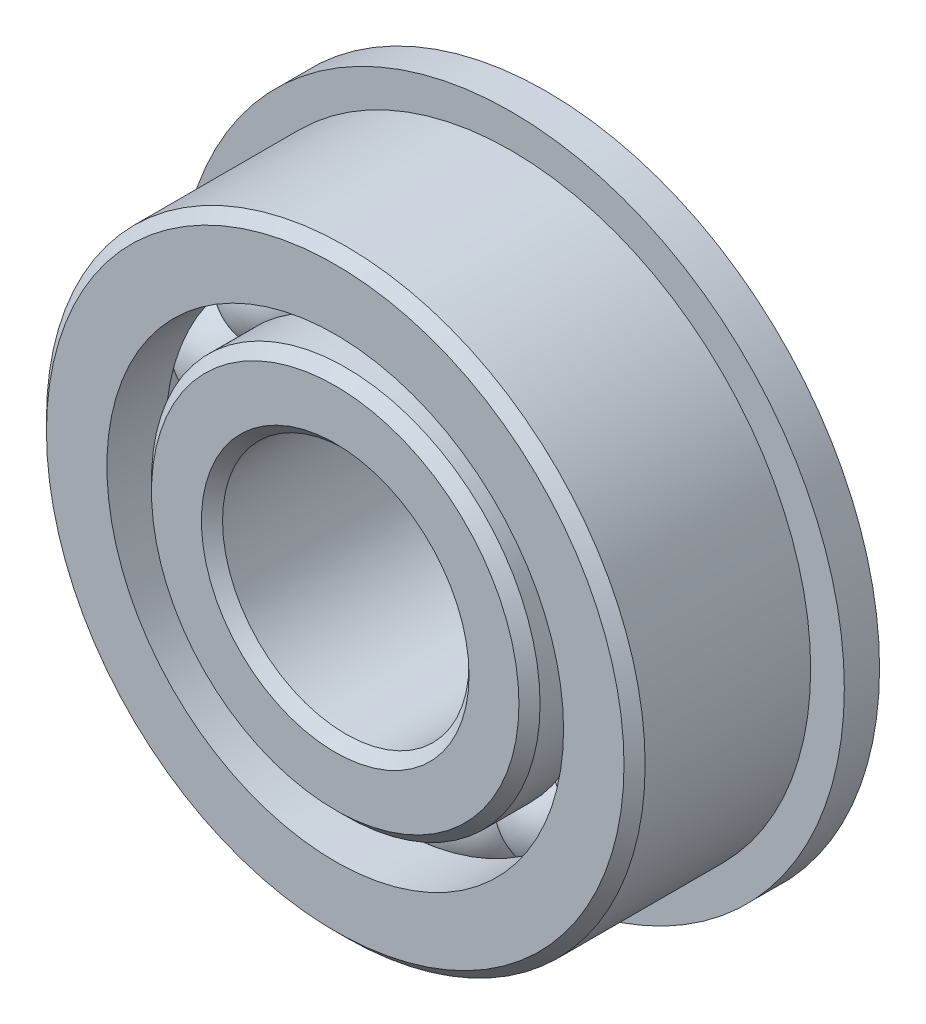
ISO-10303-21;
HEADER;
FILE_DESCRIPTION(('STEP AP214'),'2;1');
FILE_NAME('part.step','',(''),(''),'','','');
FILE_SCHEMA(('AUTOMOTIVE_DESIGN { 1 0 10303 214 1 1 1 1 }'));
ENDSEC;
DATA;
#1=APPLICATION_CONTEXT('core data for automotive mechanical design processes');
#2=APPLICATION_PROTOCOL_DEFINITION('international standard','automotive_design',2000,#1);
#3=PRODUCT_CONTEXT('',#1,'mechanical');
#4=PRODUCT('Part','Part','',(#3));
#5=PRODUCT_RELATED_PRODUCT_CATEGORY('part','',(#4));
#6=PRODUCT_DEFINITION_FORMATION('','',#4);
#7=PRODUCT_DEFINITION_CONTEXT('part definition',#1,'design');
#8=PRODUCT_DEFINITION('design','',#6,#7);
#9=PRODUCT_DEFINITION_SHAPE('','',#8);
#10=(LENGTH_UNIT() NAMED_UNIT(*) SI_UNIT(.MILLI.,.METRE.));
#11=(NAMED_UNIT(*) PLANE_ANGLE_UNIT() SI_UNIT($,.RADIAN.));
#12=(NAMED_UNIT(*) SI_UNIT($,.STERADIAN.) SOLID_ANGLE_UNIT());
#13=UNCERTAINTY_MEASURE_WITH_UNIT(LENGTH_MEASURE(1.E-05),#10,'distance_accuracy_value','');
#14=(GEOMETRIC_REPRESENTATION_CONTEXT(3) GLOBAL_UNCERTAINTY_ASSIGNED_CONTEXT((#13)) GLOBAL_UNIT_ASSIGNED_CONTEXT((#10,
#11,#12)) REPRESENTATION_CONTEXT('',''));
#15=CARTESIAN_POINT('',(0.,0.,0.));
#16=DIRECTION('',(0.,0.,1.));
#17=DIRECTION('',(1.,0.,0.));
#18=AXIS2_PLACEMENT_3D('',#15,#16,#17);
#19=CARTESIAN_POINT('',(-3.87416652529689,8.70152048404582,0.));
#20=DIRECTION('',(0.,0.,1.));
#21=DIRECTION('',(-0.406736643075789,0.913545457642606,0.));
#22=AXIS2_PLACEMENT_3D('',#19,#20,#21);
#23=SPHERICAL_SURFACE('',#22,2.25154625658889);
#24=CARTESIAN_POINT('',(-3.87416652529689,8.70152048404582,2.25154625658889));
#25=VERTEX_POINT('',#24);
#26=VERTEX_LOOP('',#25);
#27=FACE_BOUND('',#26,.T.);
#28=ADVANCED_FACE('F37',(#27),#23,.T.);
#29=CLOSED_SHELL('',(#28));
#30=MANIFOLD_SOLID_BREP('B2',#29);
#31=CARTESIAN_POINT('',(-7.0784544626721,6.37346902556821,0.));
#32=DIRECTION('',(0.,0.,1.));
#33=DIRECTION('',(-0.743144825477386,0.669130606358867,0.));
#34=AXIS2_PLACEMENT_3D('',#31,#32,#33);
#35=SPHERICAL_SURFACE('',#34,2.25154625658889);
#36=CARTESIAN_POINT('',(-7.0784544626721,6.37346902556821,2.25154625658889));
#37=VERTEX_POINT('',#36);
#38=VERTEX_LOOP('',#37);
#39=FACE_BOUND('',#38,.T.);
#40=ADVANCED_FACE('F57',(#39),#35,.T.);
#41=CLOSED_SHELL('',(#40));
#42=MANIFOLD_SOLID_BREP('B6',#41);
#43=CARTESIAN_POINT('',(-9.05881331771131,2.94338687142147,0.));
#44=DIRECTION('',(0.,0.,1.));
#45=DIRECTION('',(-0.95105651629515,0.309016994374957,0.));
#46=AXIS2_PLACEMENT_3D('',#43,#44,#45);
#47=SPHERICAL_SURFACE('',#46,2.25154625658889);
#48=CARTESIAN_POINT('',(-9.05881331771131,2.94338687142147,2.25154625658889));
#49=VERTEX_POINT('',#48);
#50=VERTEX_LOOP('',#49);
#51=FACE_BOUND('',#50,.T.);
#52=ADVANCED_FACE('F77',(#51),#47,.T.);
#53=CLOSED_SHELL('',(#52));
#54=MANIFOLD_SOLID_BREP('B33',#53);
#55=CARTESIAN_POINT('',(-9.47282105338281,-0.995633612624306,0.));
#56=DIRECTION('',(0.,0.,1.));
#57=DIRECTION('',(-0.994521895368274,-0.104528463267644,0.));
#58=AXIS2_PLACEMENT_3D('',#55,#56,#57);
#59=SPHERICAL_SURFACE('',#58,2.25154625658889);
#60=CARTESIAN_POINT('',(-9.47282105338281,-0.995633612624306,2.25154625658889));
#61=VERTEX_POINT('',#60);
#62=VERTEX_LOOP('',#61);
#63=FACE_BOUND('',#62,.T.);
#64=ADVANCED_FACE('F97',(#63),#59,.T.);
#65=CLOSED_SHELL('',(#64));
#66=MANIFOLD_SOLID_BREP('B53',#65);
#67=CARTESIAN_POINT('',(-8.24889197104682,-4.76249999999992,0.));
#68=DIRECTION('',(0.,0.,1.));
#69=DIRECTION('',(-0.866025403784443,-0.499999999999992,0.));
#70=AXIS2_PLACEMENT_3D('',#67,#68,#69);
#71=SPHERICAL_SURFACE('',#70,2.25154625658889);
#72=CARTESIAN_POINT('',(-8.24889197104682,-4.76249999999992,2.25154625658889));
#73=VERTEX_POINT('',#72);
#74=VERTEX_LOOP('',#73);
#75=FACE_BOUND('',#74,.T.);
#76=ADVANCED_FACE('F117',(#75),#71,.T.);
#77=CLOSED_SHELL('',(#76));
#78=MANIFOLD_SOLID_BREP('B73',#77);
#79=CARTESIAN_POINT('',(-5.59865452808587,-7.70588687142133,0.));
#80=DIRECTION('',(0.,0.,1.));
#81=DIRECTION('',(-0.58778525229248,-0.809016994374943,0.));
#82=AXIS2_PLACEMENT_3D('',#79,#80,#81);
#83=SPHERICAL_SURFACE('',#82,2.25154625658889);
#84=CARTESIAN_POINT('',(-5.59865452808587,-7.70588687142133,2.25154625658889));
#85=VERTEX_POINT('',#84);
#86=VERTEX_LOOP('',#85);
#87=FACE_BOUND('',#86,.T.);
#88=ADVANCED_FACE('F137',(#87),#83,.T.);
#89=CLOSED_SHELL('',(#88));
#90=MANIFOLD_SOLID_BREP('B93',#89);
#91=CARTESIAN_POINT('',(-1.98035885503923,-9.31685589698948,0.));
#92=DIRECTION('',(0.,0.,1.));
#93=DIRECTION('',(-0.207911690817766,-0.978147600733804,0.));
#94=AXIS2_PLACEMENT_3D('',#91,#92,#93);
#95=SPHERICAL_SURFACE('',#94,2.25154625658889);
#96=CARTESIAN_POINT('',(-1.98035885503923,-9.31685589698948,2.25154625658889));
#97=VERTEX_POINT('',#96);
#98=VERTEX_LOOP('',#97);
#99=FACE_BOUND('',#98,.T.);
#100=ADVANCED_FACE('F157',(#99),#95,.T.);
#101=CLOSED_SHELL('',(#100));
#102=MANIFOLD_SOLID_BREP('B113',#101);
#103=CARTESIAN_POINT('',(1.9803588550391,-9.31685589698951,0.));
#104=DIRECTION('',(0.,0.,1.));
#105=DIRECTION('',(0.207911690817753,-0.978147600733807,0.));
#106=AXIS2_PLACEMENT_3D('',#103,#104,#105);
#107=SPHERICAL_SURFACE('',#106,2.25154625658889);
#108=CARTESIAN_POINT('',(1.9803588550391,-9.31685589698951,2.25154625658889));
#109=VERTEX_POINT('',#108);
#110=VERTEX_LOOP('',#109);
#111=FACE_BOUND('',#110,.T.);
#112=ADVANCED_FACE('F177',(#111),#107,.T.);
#113=CLOSED_SHELL('',(#112));
#114=MANIFOLD_SOLID_BREP('B133',#113);
#115=CARTESIAN_POINT('',(5.59865452808577,-7.7058868714214,0.));
#116=DIRECTION('',(0.,0.,1.));
#117=DIRECTION('',(0.587785252292469,-0.80901699437495,0.));
#118=AXIS2_PLACEMENT_3D('',#115,#116,#117);
#119=SPHERICAL_SURFACE('',#118,2.25154625658889);
#120=CARTESIAN_POINT('',(5.59865452808577,-7.7058868714214,2.25154625658889));
#121=VERTEX_POINT('',#120);
#122=VERTEX_LOOP('',#121);
#123=FACE_BOUND('',#122,.T.);
#124=ADVANCED_FACE('F197',(#123),#119,.T.);
#125=CLOSED_SHELL('',(#124));
#126=MANIFOLD_SOLID_BREP('B153',#125);
#127=CARTESIAN_POINT('',(8.24889197104676,-4.76250000000004,0.));
#128=DIRECTION('',(0.,0.,1.));
#129=DIRECTION('',(0.866025403784436,-0.500000000000004,0.));
#130=AXIS2_PLACEMENT_3D('',#127,#128,#129);
#131=SPHERICAL_SURFACE('',#130,2.25154625658889);
#132=CARTESIAN_POINT('',(8.24889197104676,-4.76250000000004,2.25154625658889));
#133=VERTEX_POINT('',#132);
#134=VERTEX_LOOP('',#133);
#135=FACE_BOUND('',#134,.T.);
#136=ADVANCED_FACE('F217',(#135),#131,.T.);
#137=CLOSED_SHELL('',(#136));
#138=MANIFOLD_SOLID_BREP('B173',#137);
#139=CARTESIAN_POINT('',(9.4728210533828,-0.995633612624434,0.));
#140=DIRECTION('',(0.,0.,1.));
#141=DIRECTION('',(0.994521895368273,-0.104528463267657,0.));
#142=AXIS2_PLACEMENT_3D('',#139,#140,#141);
#143=SPHERICAL_SURFACE('',#142,2.25154625658889);
#144=CARTESIAN_POINT('',(9.4728210533828,-0.995633612624434,2.25154625658889));
#145=VERTEX_POINT('',#144);
#146=VERTEX_LOOP('',#145);
#147=FACE_BOUND('',#146,.T.);
#148=ADVANCED_FACE('F237',(#147),#143,.T.);
#149=CLOSED_SHELL('',(#148));
#150=MANIFOLD_SOLID_BREP('B193',#149);
#151=CARTESIAN_POINT('',(9.05881331771134,2.94338687142135,0.));
#152=DIRECTION('',(0.,0.,1.));
#153=DIRECTION('',(0.951056516295154,0.309016994374945,0.));
#154=AXIS2_PLACEMENT_3D('',#151,#152,#153);
#155=SPHERICAL_SURFACE('',#154,2.25154625658889);
#156=CARTESIAN_POINT('',(9.05881331771134,2.94338687142135,2.25154625658889));
#157=VERTEX_POINT('',#156);
#158=VERTEX_LOOP('',#157);
#159=FACE_BOUND('',#158,.T.);
#160=ADVANCED_FACE('F257',(#159),#155,.T.);
#161=CLOSED_SHELL('',(#160));
#162=MANIFOLD_SOLID_BREP('B213',#161);
#163=CARTESIAN_POINT('',(7.07845446267219,6.37346902556811,0.));
#164=DIRECTION('',(0.,0.,1.));
#165=DIRECTION('',(0.743144825477395,0.669130606358857,0.));
#166=AXIS2_PLACEMENT_3D('',#163,#164,#165);
#167=SPHERICAL_SURFACE('',#166,2.25154625658889);
#168=CARTESIAN_POINT('',(7.07845446267219,6.37346902556811,2.25154625658889));
#169=VERTEX_POINT('',#168);
#170=VERTEX_LOOP('',#169);
#171=FACE_BOUND('',#170,.T.);
#172=ADVANCED_FACE('F277',(#171),#167,.T.);
#173=CLOSED_SHELL('',(#172));
#174=MANIFOLD_SOLID_BREP('B233',#173);
#175=CARTESIAN_POINT('',(3.874166525297,8.70152048404577,0.));
#176=DIRECTION('',(0.,0.,1.));
#177=DIRECTION('',(0.406736643075801,0.913545457642601,0.));
#178=AXIS2_PLACEMENT_3D('',#175,#176,#177);
#179=SPHERICAL_SURFACE('',#178,2.25154625658889);
#180=CARTESIAN_POINT('',(3.874166525297,8.70152048404577,2.25154625658889));
#181=VERTEX_POINT('',#180);
#182=VERTEX_LOOP('',#181);
#183=FACE_BOUND('',#182,.T.);
#184=ADVANCED_FACE('F297',(#183),#179,.T.);
#185=CLOSED_SHELL('',(#184));
#186=MANIFOLD_SOLID_BREP('B253',#185);
#187=CARTESIAN_POINT('',(0.,9.525,0.));
#188=DIRECTION('',(0.,0.,1.));
#189=DIRECTION('',(0.,1.,0.));
#190=AXIS2_PLACEMENT_3D('',#187,#188,#189);
#191=SPHERICAL_SURFACE('',#190,2.25154625658889);
#192=CARTESIAN_POINT('',(0.,9.525,2.25154625658889));
#193=VERTEX_POINT('',#192);
#194=VERTEX_LOOP('',#193);
#195=FACE_BOUND('',#194,.T.);
#196=ADVANCED_FACE('F319',(#195),#191,.T.);
#197=CLOSED_SHELL('',(#196));
#198=MANIFOLD_SOLID_BREP('B273',#197);
#199=CARTESIAN_POINT('',(0.,0.,4.28625));
#200=DIRECTION('',(0.,0.,-1.));
#201=DIRECTION('',(-1.,0.,0.));
#202=AXIS2_PLACEMENT_3D('',#199,#200,#201);
#203=CONICAL_SURFACE('',#202,8.75741758241758,0.785398163397447);
#204=CARTESIAN_POINT('',(0.,0.,4.7625));
#205=DIRECTION('',(0.,0.,1.));
#206=DIRECTION('',(1.,0.,0.));
#207=AXIS2_PLACEMENT_3D('',#204,#205,#206);
#208=CIRCLE('',#207,8.28116758241759);
#209=CARTESIAN_POINT('',(8.28116758241759,0.,4.7625));
#210=VERTEX_POINT('',#209);
#211=EDGE_CURVE('E372',#210,#210,#208,.T.);
#212=ORIENTED_EDGE('',*,*,#211,.F.);
#213=EDGE_LOOP('',(#212));
#214=FACE_BOUND('',#213,.T.);
#215=CARTESIAN_POINT('',(0.,0.,4.28625));
#216=DIRECTION('',(0.,0.,1.));
#217=DIRECTION('',(1.,0.,0.));
#218=AXIS2_PLACEMENT_3D('',#215,#216,#217);
#219=CIRCLE('',#218,8.75741758241758);
#220=CARTESIAN_POINT('',(8.75741758241758,0.,4.28625));
#221=VERTEX_POINT('',#220);
#222=EDGE_CURVE('E318',#221,#221,#219,.T.);
#223=ORIENTED_EDGE('',*,*,#222,.T.);
#224=EDGE_LOOP('',(#223));
#225=FACE_BOUND('',#224,.T.);
#226=ADVANCED_FACE('F338',(#214,#225),#203,.T.);
#227=CARTESIAN_POINT('',(0.,0.,4.7625));
#228=DIRECTION('',(0.,0.,1.));
#229=DIRECTION('',(1.,0.,0.));
#230=AXIS2_PLACEMENT_3D('',#227,#228,#229);
#231=CYLINDRICAL_SURFACE('',#230,8.75741758241759);
#232=ORIENTED_EDGE('',*,*,#222,.F.);
#233=EDGE_LOOP('',(#232));
#234=FACE_BOUND('',#233,.T.);
#235=CARTESIAN_POINT('',(0.,0.,2.11666666666666));
#236=DIRECTION('',(0.,0.,1.));
#237=DIRECTION('',(1.,0.,0.));
#238=AXIS2_PLACEMENT_3D('',#235,#236,#237);
#239=CIRCLE('',#238,8.75741758241759);
#240=CARTESIAN_POINT('',(8.75741758241759,0.,2.11666666666666));
#241=VERTEX_POINT('',#240);
#242=EDGE_CURVE('E344',#241,#241,#239,.T.);
#243=ORIENTED_EDGE('',*,*,#242,.T.);
#244=EDGE_LOOP('',(#243));
#245=FACE_BOUND('',#244,.T.);
#246=ADVANCED_FACE('F379',(#234,#245),#231,.T.);
#247=CARTESIAN_POINT('',(0.,0.,0.));
#248=DIRECTION('',(0.,0.,1.));
#249=DIRECTION('',(1.,0.,0.));
#250=AXIS2_PLACEMENT_3D('',#247,#248,#249);
#251=TOROIDAL_SURFACE('',#250,9.52499999999999,2.25154625658889);
#252=ORIENTED_EDGE('',*,*,#242,.F.);
#253=EDGE_LOOP('',(#252));
#254=FACE_BOUND('',#253,.T.);
#255=CARTESIAN_POINT('',(0.,0.,-2.11666666666667));
#256=DIRECTION('',(0.,0.,1.));
#257=DIRECTION('',(1.,0.,0.));
#258=AXIS2_PLACEMENT_3D('',#255,#256,#257);
#259=CIRCLE('',#258,8.75741758241759);
#260=CARTESIAN_POINT('',(8.75741758241759,0.,-2.11666666666667));
#261=VERTEX_POINT('',#260);
#262=EDGE_CURVE('E348',#261,#261,#259,.T.);
#263=ORIENTED_EDGE('',*,*,#262,.T.);
#264=EDGE_LOOP('',(#263));
#265=FACE_BOUND('',#264,.T.);
#266=ADVANCED_FACE('F383',(#254,#265),#251,.F.);
#267=CARTESIAN_POINT('',(0.,0.,4.7625));
#268=DIRECTION('',(0.,0.,1.));
#269=DIRECTION('',(1.,0.,0.));
#270=AXIS2_PLACEMENT_3D('',#267,#268,#269);
#271=CYLINDRICAL_SURFACE('',#270,8.75741758241759);
#272=ORIENTED_EDGE('',*,*,#262,.F.);
#273=EDGE_LOOP('',(#272));
#274=FACE_BOUND('',#273,.T.);
#275=CARTESIAN_POINT('',(0.,0.,-5.87375));
#276=DIRECTION('',(0.,0.,1.));
#277=DIRECTION('',(1.,0.,0.));
#278=AXIS2_PLACEMENT_3D('',#275,#276,#277);
#279=CIRCLE('',#278,8.75741758241758);
#280=CARTESIAN_POINT('',(8.75741758241758,0.,-5.87375));
#281=VERTEX_POINT('',#280);
#282=EDGE_CURVE('E352',#281,#281,#279,.T.);
#283=ORIENTED_EDGE('',*,*,#282,.T.);
#284=EDGE_LOOP('',(#283));
#285=FACE_BOUND('',#284,.T.);
#286=ADVANCED_FACE('F388',(#274,#285),#271,.T.);
#287=CARTESIAN_POINT('',(0.,0.,-6.35));
#288=DIRECTION('',(0.,0.,1.));
#289=DIRECTION('',(1.,0.,0.));
#290=AXIS2_PLACEMENT_3D('',#287,#288,#289);
#291=CONICAL_SURFACE('',#290,8.28116758241759,0.785398163397447);
#292=ORIENTED_EDGE('',*,*,#282,.F.);
#293=EDGE_LOOP('',(#292));
#294=FACE_BOUND('',#293,.T.);
#295=CARTESIAN_POINT('',(0.,0.,-6.35));
#296=DIRECTION('',(0.,0.,1.));
#297=DIRECTION('',(1.,0.,0.));
#298=AXIS2_PLACEMENT_3D('',#295,#296,#297);
#299=CIRCLE('',#298,8.28116758241759);
#300=CARTESIAN_POINT('',(8.28116758241759,0.,-6.35));
#301=VERTEX_POINT('',#300);
#302=EDGE_CURVE('E357',#301,#301,#299,.T.);
#303=ORIENTED_EDGE('',*,*,#302,.T.);
#304=EDGE_LOOP('',(#303));
#305=FACE_BOUND('',#304,.T.);
#306=ADVANCED_FACE('F394',(#294,#305),#291,.T.);
#307=CARTESIAN_POINT('',(0.,8.28116758241759,-6.35));
#308=DIRECTION('',(0.,0.,1.));
#309=DIRECTION('',(1.,0.,0.));
#310=AXIS2_PLACEMENT_3D('',#307,#308,#309);
#311=PLANE('',#310);
#312=ORIENTED_EDGE('',*,*,#302,.F.);
#313=EDGE_LOOP('',(#312));
#314=FACE_BOUND('',#313,.T.);
#315=CARTESIAN_POINT('',(0.,0.,-6.35));
#316=DIRECTION('',(0.,0.,1.));
#317=DIRECTION('',(1.,0.,0.));
#318=AXIS2_PLACEMENT_3D('',#315,#316,#317);
#319=CIRCLE('',#318,6.0325);
#320=CARTESIAN_POINT('',(6.0325,0.,-6.35));
#321=VERTEX_POINT('',#320);
#322=EDGE_CURVE('E360',#321,#321,#319,.T.);
#323=ORIENTED_EDGE('',*,*,#322,.T.);
#324=EDGE_LOOP('',(#323));
#325=FACE_BOUND('',#324,.T.);
#326=ADVANCED_FACE('F398',(#314,#325),#311,.F.);
#327=CARTESIAN_POINT('',(0.,0.,-5.87375));
#328=DIRECTION('',(0.,0.,-1.));
#329=DIRECTION('',(-1.,0.,0.));
#330=AXIS2_PLACEMENT_3D('',#327,#328,#329);
#331=CONICAL_SURFACE('',#330,5.55625,0.785398163397448);
#332=ORIENTED_EDGE('',*,*,#322,.F.);
#333=EDGE_LOOP('',(#332));
#334=FACE_BOUND('',#333,.T.);
#335=CARTESIAN_POINT('',(0.,0.,-5.87375));
#336=DIRECTION('',(0.,0.,1.));
#337=DIRECTION('',(1.,0.,0.));
#338=AXIS2_PLACEMENT_3D('',#335,#336,#337);
#339=CIRCLE('',#338,5.55625);
#340=CARTESIAN_POINT('',(5.55625,0.,-5.87375));
#341=VERTEX_POINT('',#340);
#342=EDGE_CURVE('E363',#341,#341,#339,.T.);
#343=ORIENTED_EDGE('',*,*,#342,.T.);
#344=EDGE_LOOP('',(#343));
#345=FACE_BOUND('',#344,.T.);
#346=ADVANCED_FACE('F402',(#334,#345),#331,.F.);
#347=CARTESIAN_POINT('',(0.,0.,4.7625));
#348=DIRECTION('',(0.,0.,1.));
#349=DIRECTION('',(1.,0.,0.));
#350=AXIS2_PLACEMENT_3D('',#347,#348,#349);
#351=CYLINDRICAL_SURFACE('',#350,5.55625);
#352=ORIENTED_EDGE('',*,*,#342,.F.);
#353=EDGE_LOOP('',(#352));
#354=FACE_BOUND('',#353,.T.);
#355=CARTESIAN_POINT('',(0.,0.,4.28625));
#356=DIRECTION('',(0.,0.,1.));
#357=DIRECTION('',(1.,0.,0.));
#358=AXIS2_PLACEMENT_3D('',#355,#356,#357);
#359=CIRCLE('',#358,5.55625);
#360=CARTESIAN_POINT('',(5.55625,0.,4.28625));
#361=VERTEX_POINT('',#360);
#362=EDGE_CURVE('E366',#361,#361,#359,.T.);
#363=ORIENTED_EDGE('',*,*,#362,.T.);
#364=EDGE_LOOP('',(#363));
#365=FACE_BOUND('',#364,.T.);
#366=ADVANCED_FACE('F406',(#354,#365),#351,.F.);
#367=CARTESIAN_POINT('',(0.,0.,4.7625));
#368=DIRECTION('',(0.,0.,1.));
#369=DIRECTION('',(1.,0.,0.));
#370=AXIS2_PLACEMENT_3D('',#367,#368,#369);
#371=CONICAL_SURFACE('',#370,6.0325,0.785398163397449);
#372=ORIENTED_EDGE('',*,*,#362,.F.);
#373=EDGE_LOOP('',(#372));
#374=FACE_BOUND('',#373,.T.);
#375=CARTESIAN_POINT('',(0.,0.,4.7625));
#376=DIRECTION('',(0.,0.,1.));
#377=DIRECTION('',(1.,0.,0.));
#378=AXIS2_PLACEMENT_3D('',#375,#376,#377);
#379=CIRCLE('',#378,6.0325);
#380=CARTESIAN_POINT('',(6.0325,0.,4.7625));
#381=VERTEX_POINT('',#380);
#382=EDGE_CURVE('E369',#381,#381,#379,.T.);
#383=ORIENTED_EDGE('',*,*,#382,.T.);
#384=EDGE_LOOP('',(#383));
#385=FACE_BOUND('',#384,.T.);
#386=ADVANCED_FACE('F410',(#374,#385),#371,.F.);
#387=CARTESIAN_POINT('',(0.,6.0325,4.7625));
#388=DIRECTION('',(0.,0.,-1.));
#389=DIRECTION('',(-1.,0.,0.));
#390=AXIS2_PLACEMENT_3D('',#387,#388,#389);
#391=PLANE('',#390);
#392=ORIENTED_EDGE('',*,*,#382,.F.);
#393=EDGE_LOOP('',(#392));
#394=FACE_BOUND('',#393,.T.);
#395=ORIENTED_EDGE('',*,*,#211,.T.);
#396=EDGE_LOOP('',(#395));
#397=FACE_BOUND('',#396,.T.);
#398=ADVANCED_FACE('F376',(#394,#397),#391,.F.);
#399=CLOSED_SHELL('',(#226,#246,#266,#286,#306,#326,#346,#366,#386,#398));
#400=MANIFOLD_SOLID_BREP('B293',#399);
#401=CARTESIAN_POINT('',(0.,0.,4.28625));
#402=DIRECTION('',(0.,0.,-1.));
#403=DIRECTION('',(-1.,0.,0.));
#404=AXIS2_PLACEMENT_3D('',#401,#402,#403);
#405=CONICAL_SURFACE('',#404,13.49375,0.785398163397447);
#406=CARTESIAN_POINT('',(0.,0.,4.7625));
#407=DIRECTION('',(0.,0.,1.));
#408=DIRECTION('',(1.,0.,0.));
#409=AXIS2_PLACEMENT_3D('',#406,#407,#408);
#410=CIRCLE('',#409,13.0175);
#411=CARTESIAN_POINT('',(13.0175,0.,4.7625));
#412=VERTEX_POINT('',#411);
#413=EDGE_CURVE('E511',#412,#412,#410,.T.);
#414=ORIENTED_EDGE('',*,*,#413,.F.);
#415=EDGE_LOOP('',(#414));
#416=FACE_BOUND('',#415,.T.);
#417=CARTESIAN_POINT('',(0.,0.,4.28625));
#418=DIRECTION('',(0.,0.,1.));
#419=DIRECTION('',(1.,0.,0.));
#420=AXIS2_PLACEMENT_3D('',#417,#418,#419);
#421=CIRCLE('',#420,13.49375);
#422=CARTESIAN_POINT('',(13.49375,0.,4.28625));
#423=VERTEX_POINT('',#422);
#424=EDGE_CURVE('E337',#423,#423,#421,.T.);
#425=ORIENTED_EDGE('',*,*,#424,.T.);
#426=EDGE_LOOP('',(#425));
#427=FACE_BOUND('',#426,.T.);
#428=ADVANCED_FACE('F489',(#416,#427),#405,.T.);
#429=CARTESIAN_POINT('',(0.,0.,4.7625));
#430=DIRECTION('',(0.,0.,1.));
#431=DIRECTION('',(1.,0.,0.));
#432=AXIS2_PLACEMENT_3D('',#429,#430,#431);
#433=CYLINDRICAL_SURFACE('',#432,13.49375);
#434=CARTESIAN_POINT('',(0.,0.,-3.175));
#435=DIRECTION('',(0.,0.,1.));
#436=DIRECTION('',(1.,0.,0.));
#437=AXIS2_PLACEMENT_3D('',#434,#435,#436);
#438=CIRCLE('',#437,13.49375);
#439=CARTESIAN_POINT('',(13.49375,0.,-3.175));
#440=VERTEX_POINT('',#439);
#441=EDGE_CURVE('E514',#440,#440,#438,.T.);
#442=ORIENTED_EDGE('',*,*,#441,.T.);
#443=EDGE_LOOP('',(#442));
#444=FACE_BOUND('',#443,.T.);
#445=ORIENTED_EDGE('',*,*,#424,.F.);
#446=EDGE_LOOP('',(#445));
#447=FACE_BOUND('',#446,.T.);
#448=ADVANCED_FACE('F534',(#444,#447),#433,.T.);
#449=CARTESIAN_POINT('',(0.,13.0175,-4.7625));
#450=DIRECTION('',(0.,0.,1.));
#451=DIRECTION('',(1.,0.,0.));
#452=AXIS2_PLACEMENT_3D('',#449,#450,#451);
#453=PLANE('',#452);
#454=CARTESIAN_POINT('',(0.,0.,-4.7625));
#455=DIRECTION('',(0.,0.,1.));
#456=DIRECTION('',(1.,0.,0.));
#457=AXIS2_PLACEMENT_3D('',#454,#455,#456);
#458=CIRCLE('',#457,10.2925824175824);
#459=CARTESIAN_POINT('',(10.2925824175824,0.,-4.7625));
#460=VERTEX_POINT('',#459);
#461=EDGE_CURVE('E495',#460,#460,#458,.T.);
#462=ORIENTED_EDGE('',*,*,#461,.T.);
#463=EDGE_LOOP('',(#462));
#464=FACE_BOUND('',#463,.T.);
#465=CARTESIAN_POINT('',(0.,0.,-4.7625));
#466=DIRECTION('',(0.,0.,-1.));
#467=DIRECTION('',(-1.,0.,0.));
#468=AXIS2_PLACEMENT_3D('',#465,#466,#467);
#469=CIRCLE('',#468,15.0114);
#470=CARTESIAN_POINT('',(-15.0114,0.,-4.7625));
#471=VERTEX_POINT('',#470);
#472=EDGE_CURVE('E517',#471,#471,#469,.T.);
#473=ORIENTED_EDGE('',*,*,#472,.T.);
#474=EDGE_LOOP('',(#473));
#475=FACE_BOUND('',#474,.T.);
#476=ADVANCED_FACE('F537',(#464,#475),#453,.F.);
#477=CARTESIAN_POINT('',(0.,0.,4.7625));
#478=DIRECTION('',(0.,0.,1.));
#479=DIRECTION('',(1.,0.,0.));
#480=AXIS2_PLACEMENT_3D('',#477,#478,#479);
#481=CYLINDRICAL_SURFACE('',#480,10.2925824175824);
#482=CARTESIAN_POINT('',(0.,0.,-2.11666666666667));
#483=DIRECTION('',(0.,0.,1.));
#484=DIRECTION('',(1.,0.,0.));
#485=AXIS2_PLACEMENT_3D('',#482,#483,#484);
#486=CIRCLE('',#485,10.2925824175824);
#487=CARTESIAN_POINT('',(10.2925824175824,0.,-2.11666666666667));
#488=VERTEX_POINT('',#487);
#489=EDGE_CURVE('E499',#488,#488,#486,.T.);
#490=ORIENTED_EDGE('',*,*,#489,.T.);
#491=EDGE_LOOP('',(#490));
#492=FACE_BOUND('',#491,.T.);
#493=ORIENTED_EDGE('',*,*,#461,.F.);
#494=EDGE_LOOP('',(#493));
#495=FACE_BOUND('',#494,.T.);
#496=ADVANCED_FACE('F542',(#492,#495),#481,.F.);
#497=CARTESIAN_POINT('',(0.,0.,0.));
#498=DIRECTION('',(0.,0.,1.));
#499=DIRECTION('',(1.,0.,0.));
#500=AXIS2_PLACEMENT_3D('',#497,#498,#499);
#501=TOROIDAL_SURFACE('',#500,9.525,2.25154625658889);
#502=ORIENTED_EDGE('',*,*,#489,.F.);
#503=EDGE_LOOP('',(#502));
#504=FACE_BOUND('',#503,.T.);
#505=CARTESIAN_POINT('',(0.,0.,2.11666666666667));
#506=DIRECTION('',(0.,0.,1.));
#507=DIRECTION('',(1.,0.,0.));
#508=AXIS2_PLACEMENT_3D('',#505,#506,#507);
#509=CIRCLE('',#508,10.2925824175824);
#510=CARTESIAN_POINT('',(10.2925824175824,0.,2.11666666666667));
#511=VERTEX_POINT('',#510);
#512=EDGE_CURVE('E503',#511,#511,#509,.T.);
#513=ORIENTED_EDGE('',*,*,#512,.T.);
#514=EDGE_LOOP('',(#513));
#515=FACE_BOUND('',#514,.T.);
#516=ADVANCED_FACE('F548',(#504,#515),#501,.F.);
#517=CARTESIAN_POINT('',(0.,0.,4.7625));
#518=DIRECTION('',(0.,0.,1.));
#519=DIRECTION('',(1.,0.,0.));
#520=AXIS2_PLACEMENT_3D('',#517,#518,#519);
#521=CYLINDRICAL_SURFACE('',#520,10.2925824175824);
#522=ORIENTED_EDGE('',*,*,#512,.F.);
#523=EDGE_LOOP('',(#522));
#524=FACE_BOUND('',#523,.T.);
#525=CARTESIAN_POINT('',(0.,0.,4.7625));
#526=DIRECTION('',(0.,0.,1.));
#527=DIRECTION('',(1.,0.,0.));
#528=AXIS2_PLACEMENT_3D('',#525,#526,#527);
#529=CIRCLE('',#528,10.2925824175824);
#530=CARTESIAN_POINT('',(10.2925824175824,0.,4.7625));
#531=VERTEX_POINT('',#530);
#532=EDGE_CURVE('E508',#531,#531,#529,.T.);
#533=ORIENTED_EDGE('',*,*,#532,.T.);
#534=EDGE_LOOP('',(#533));
#535=FACE_BOUND('',#534,.T.);
#536=ADVANCED_FACE('F552',(#524,#535),#521,.F.);
#537=CARTESIAN_POINT('',(0.,13.0175,4.7625));
#538=DIRECTION('',(0.,0.,-1.));
#539=DIRECTION('',(-1.,0.,0.));
#540=AXIS2_PLACEMENT_3D('',#537,#538,#539);
#541=PLANE('',#540);
#542=ORIENTED_EDGE('',*,*,#532,.F.);
#543=EDGE_LOOP('',(#542));
#544=FACE_BOUND('',#543,.T.);
#545=ORIENTED_EDGE('',*,*,#413,.T.);
#546=EDGE_LOOP('',(#545));
#547=FACE_BOUND('',#546,.T.);
#548=ADVANCED_FACE('F530',(#544,#547),#541,.F.);
#549=CARTESIAN_POINT('',(0.,10.2925824175824,-3.175));
#550=DIRECTION('',(0.,0.,1.));
#551=DIRECTION('',(1.,0.,0.));
#552=AXIS2_PLACEMENT_3D('',#549,#550,#551);
#553=PLANE('',#552);
#554=CARTESIAN_POINT('',(0.,0.,-3.175));
#555=DIRECTION('',(0.,0.,-1.));
#556=DIRECTION('',(-1.,0.,0.));
#557=AXIS2_PLACEMENT_3D('',#554,#555,#556);
#558=CIRCLE('',#557,15.0114);
#559=CARTESIAN_POINT('',(-15.0114,0.,-3.175));
#560=VERTEX_POINT('',#559);
#561=EDGE_CURVE('E520',#560,#560,#558,.T.);
#562=ORIENTED_EDGE('',*,*,#561,.F.);
#563=EDGE_LOOP('',(#562));
#564=FACE_BOUND('',#563,.T.);
#565=ORIENTED_EDGE('',*,*,#441,.F.);
#566=EDGE_LOOP('',(#565));
#567=FACE_BOUND('',#566,.T.);
#568=ADVANCED_FACE('F527',(#564,#567),#553,.T.);
#569=CARTESIAN_POINT('',(0.,0.,-4.7625));
#570=DIRECTION('',(0.,0.,-1.));
#571=DIRECTION('',(-1.,0.,0.));
#572=AXIS2_PLACEMENT_3D('',#569,#570,#571);
#573=CYLINDRICAL_SURFACE('',#572,15.0114);
#574=ORIENTED_EDGE('',*,*,#561,.T.);
#575=EDGE_LOOP('',(#574));
#576=FACE_BOUND('',#575,.T.);
#577=ORIENTED_EDGE('',*,*,#472,.F.);
#578=EDGE_LOOP('',(#577));
#579=FACE_BOUND('',#578,.T.);
#580=ADVANCED_FACE('F524',(#576,#579),#573,.T.);
#581=CLOSED_SHELL('',(#428,#448,#476,#496,#516,#536,#548,#568,#580));
#582=MANIFOLD_SOLID_BREP('B313',#581);
#583=ADVANCED_BREP_SHAPE_REPRESENTATION('',(#18,#30,#42,#54,#66,#78,#90,#102,#114,#126,#138,
#150,#162,#174,#186,#198,#400,#582),#14);
#584=SHAPE_DEFINITION_REPRESENTATION(#9,#583);
ENDSEC;
END-ISO-10303-21;
